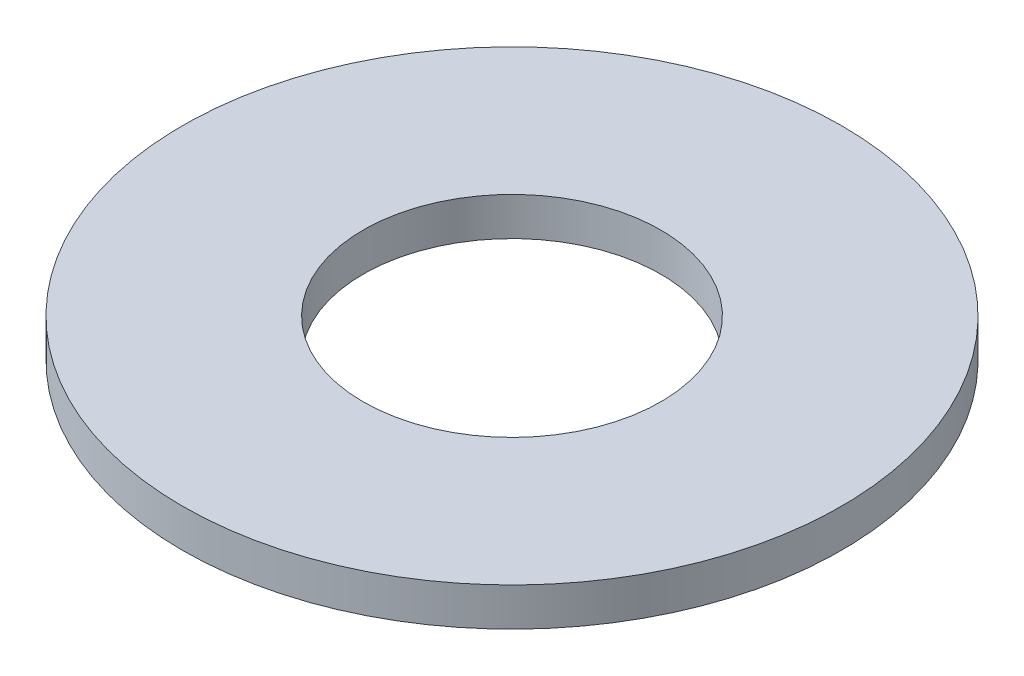
ISO-10303-21;
HEADER;
FILE_DESCRIPTION(('STEP AP214'),'2;1');
FILE_NAME('part.step','',(''),(''),'','','');
FILE_SCHEMA(('AUTOMOTIVE_DESIGN { 1 0 10303 214 1 1 1 1 }'));
ENDSEC;
DATA;
#1=APPLICATION_CONTEXT('core data for automotive mechanical design processes');
#2=APPLICATION_PROTOCOL_DEFINITION('international standard','automotive_design',2000,#1);
#3=PRODUCT_CONTEXT('',#1,'mechanical');
#4=PRODUCT('Part','Part','',(#3));
#5=PRODUCT_RELATED_PRODUCT_CATEGORY('part','',(#4));
#6=PRODUCT_DEFINITION_FORMATION('','',#4);
#7=PRODUCT_DEFINITION_CONTEXT('part definition',#1,'design');
#8=PRODUCT_DEFINITION('design','',#6,#7);
#9=PRODUCT_DEFINITION_SHAPE('','',#8);
#10=(LENGTH_UNIT() NAMED_UNIT(*) SI_UNIT(.MILLI.,.METRE.));
#11=(NAMED_UNIT(*) PLANE_ANGLE_UNIT() SI_UNIT($,.RADIAN.));
#12=(NAMED_UNIT(*) SI_UNIT($,.STERADIAN.) SOLID_ANGLE_UNIT());
#13=UNCERTAINTY_MEASURE_WITH_UNIT(LENGTH_MEASURE(1.E-05),#10,'distance_accuracy_value','');
#14=(GEOMETRIC_REPRESENTATION_CONTEXT(3) GLOBAL_UNCERTAINTY_ASSIGNED_CONTEXT((#13)) GLOBAL_UNIT_ASSIGNED_CONTEXT((#10,
#11,#12)) REPRESENTATION_CONTEXT('',''));
#15=CARTESIAN_POINT('',(0.,0.,0.));
#16=DIRECTION('',(0.,0.,1.));
#17=DIRECTION('',(1.,0.,0.));
#18=AXIS2_PLACEMENT_3D('',#15,#16,#17);
#19=CARTESIAN_POINT('',(0.,9.,0.));
#20=DIRECTION('',(0.,-1.,0.));
#21=DIRECTION('',(0.,0.,-1.));
#22=AXIS2_PLACEMENT_3D('',#19,#20,#21);
#23=CYLINDRICAL_SURFACE('',#22,77.5);
#24=CARTESIAN_POINT('',(0.,9.,0.));
#25=DIRECTION('',(0.,1.,0.));
#26=DIRECTION('',(0.,0.,1.));
#27=AXIS2_PLACEMENT_3D('',#24,#25,#26);
#28=CIRCLE('',#27,77.5);
#29=CARTESIAN_POINT('',(0.,9.,77.5));
#30=VERTEX_POINT('',#29);
#31=EDGE_CURVE('E10',#30,#30,#28,.T.);
#32=ORIENTED_EDGE('',*,*,#31,.F.);
#33=EDGE_LOOP('',(#32));
#34=FACE_BOUND('',#33,.T.);
#35=CARTESIAN_POINT('',(0.,0.,0.));
#36=DIRECTION('',(0.,1.,0.));
#37=DIRECTION('',(0.,0.,1.));
#38=AXIS2_PLACEMENT_3D('',#35,#36,#37);
#39=CIRCLE('',#38,77.5);
#40=CARTESIAN_POINT('',(0.,0.,77.5));
#41=VERTEX_POINT('',#40);
#42=EDGE_CURVE('E37',#41,#41,#39,.T.);
#43=ORIENTED_EDGE('',*,*,#42,.T.);
#44=EDGE_LOOP('',(#43));
#45=FACE_BOUND('',#44,.T.);
#46=ADVANCED_FACE('F40',(#34,#45),#23,.T.);
#47=CARTESIAN_POINT('',(0.,9.,0.));
#48=DIRECTION('',(0.,1.,0.));
#49=DIRECTION('',(0.,0.,1.));
#50=AXIS2_PLACEMENT_3D('',#47,#48,#49);
#51=PLANE('',#50);
#52=CARTESIAN_POINT('',(0.,9.,0.));
#53=DIRECTION('',(0.,1.,0.));
#54=DIRECTION('',(0.,0.,1.));
#55=AXIS2_PLACEMENT_3D('',#52,#53,#54);
#56=CIRCLE('',#55,35.);
#57=CARTESIAN_POINT('',(0.,9.,35.));
#58=VERTEX_POINT('',#57);
#59=EDGE_CURVE('E50',#58,#58,#56,.T.);
#60=ORIENTED_EDGE('',*,*,#59,.F.);
#61=EDGE_LOOP('',(#60));
#62=FACE_BOUND('',#61,.T.);
#63=ORIENTED_EDGE('',*,*,#31,.T.);
#64=EDGE_LOOP('',(#63));
#65=FACE_BOUND('',#64,.T.);
#66=ADVANCED_FACE('F59',(#62,#65),#51,.T.);
#67=CARTESIAN_POINT('',(0.,0.,0.));
#68=DIRECTION('',(0.,1.,0.));
#69=DIRECTION('',(0.,0.,1.));
#70=AXIS2_PLACEMENT_3D('',#67,#68,#69);
#71=PLANE('',#70);
#72=CARTESIAN_POINT('',(0.,0.,0.));
#73=DIRECTION('',(0.,1.,0.));
#74=DIRECTION('',(0.,0.,1.));
#75=AXIS2_PLACEMENT_3D('',#72,#73,#74);
#76=CIRCLE('',#75,35.);
#77=CARTESIAN_POINT('',(0.,0.,35.));
#78=VERTEX_POINT('',#77);
#79=EDGE_CURVE('E47',#78,#78,#76,.T.);
#80=ORIENTED_EDGE('',*,*,#79,.T.);
#81=EDGE_LOOP('',(#80));
#82=FACE_BOUND('',#81,.T.);
#83=ORIENTED_EDGE('',*,*,#42,.F.);
#84=EDGE_LOOP('',(#83));
#85=FACE_BOUND('',#84,.T.);
#86=ADVANCED_FACE('F58',(#82,#85),#71,.F.);
#87=CARTESIAN_POINT('',(0.,9.,0.));
#88=DIRECTION('',(0.,-1.,0.));
#89=DIRECTION('',(0.,0.,-1.));
#90=AXIS2_PLACEMENT_3D('',#87,#88,#89);
#91=CYLINDRICAL_SURFACE('',#90,35.);
#92=ORIENTED_EDGE('',*,*,#59,.T.);
#93=EDGE_LOOP('',(#92));
#94=FACE_BOUND('',#93,.T.);
#95=ORIENTED_EDGE('',*,*,#79,.F.);
#96=EDGE_LOOP('',(#95));
#97=FACE_BOUND('',#96,.T.);
#98=ADVANCED_FACE('F54',(#94,#97),#91,.F.);
#99=CLOSED_SHELL('',(#46,#66,#86,#98));
#100=MANIFOLD_SOLID_BREP('B2',#99);
#101=ADVANCED_BREP_SHAPE_REPRESENTATION('',(#18,#100),#14);
#102=SHAPE_DEFINITION_REPRESENTATION(#9,#101);
ENDSEC;
END-ISO-10303-21;
